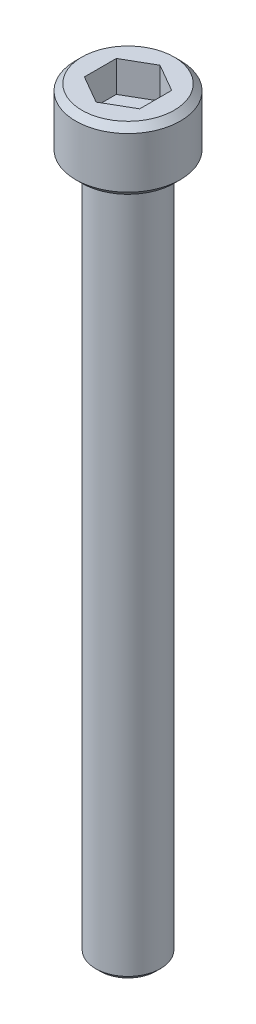
ISO-10303-21;
HEADER;
FILE_DESCRIPTION(('STEP AP214'),'2;1');
FILE_NAME('part.step','',(''),(''),'','','');
FILE_SCHEMA(('AUTOMOTIVE_DESIGN { 1 0 10303 214 1 1 1 1 }'));
ENDSEC;
DATA;
#1=APPLICATION_CONTEXT('core data for automotive mechanical design processes');
#2=APPLICATION_PROTOCOL_DEFINITION('international standard','automotive_design',2000,#1);
#3=PRODUCT_CONTEXT('',#1,'mechanical');
#4=PRODUCT('Part','Part','',(#3));
#5=PRODUCT_RELATED_PRODUCT_CATEGORY('part','',(#4));
#6=PRODUCT_DEFINITION_FORMATION('','',#4);
#7=PRODUCT_DEFINITION_CONTEXT('part definition',#1,'design');
#8=PRODUCT_DEFINITION('design','',#6,#7);
#9=PRODUCT_DEFINITION_SHAPE('','',#8);
#10=(LENGTH_UNIT() NAMED_UNIT(*) SI_UNIT(.MILLI.,.METRE.));
#11=(NAMED_UNIT(*) PLANE_ANGLE_UNIT() SI_UNIT($,.RADIAN.));
#12=(NAMED_UNIT(*) SI_UNIT($,.STERADIAN.) SOLID_ANGLE_UNIT());
#13=UNCERTAINTY_MEASURE_WITH_UNIT(LENGTH_MEASURE(1.E-05),#10,'distance_accuracy_value','');
#14=(GEOMETRIC_REPRESENTATION_CONTEXT(3) GLOBAL_UNCERTAINTY_ASSIGNED_CONTEXT((#13)) GLOBAL_UNIT_ASSIGNED_CONTEXT((#10,
#11,#12)) REPRESENTATION_CONTEXT('',''));
#15=CARTESIAN_POINT('',(0.,0.,0.));
#16=DIRECTION('',(0.,0.,1.));
#17=DIRECTION('',(1.,0.,0.));
#18=AXIS2_PLACEMENT_3D('',#15,#16,#17);
#19=CARTESIAN_POINT('',(1.778,2.064,3.07958633585746));
#20=DIRECTION('',(0.,1.,0.));
#21=DIRECTION('',(0.,0.,1.));
#22=AXIS2_PLACEMENT_3D('',#19,#20,#21);
#23=PLANE('',#22);
#24=DIRECTION('',(-0.866025403784439,0.,0.5));
#25=VECTOR('',#24,1.);
#26=CARTESIAN_POINT('',(0.,2.064,-2.05305755723831));
#27=LINE('',#26,#25);
#28=CARTESIAN_POINT('',(0.,2.064,-2.05305755723831));
#29=VERTEX_POINT('',#28);
#30=CARTESIAN_POINT('',(-1.778,2.064,-1.02652877861915));
#31=VERTEX_POINT('',#30);
#32=EDGE_CURVE('E68',#29,#31,#27,.T.);
#33=ORIENTED_EDGE('',*,*,#32,.T.);
#34=DIRECTION('',(0.,0.,1.));
#35=VECTOR('',#34,1.);
#36=CARTESIAN_POINT('',(-1.778,2.064,-1.02652877861915));
#37=LINE('',#36,#35);
#38=CARTESIAN_POINT('',(-1.778,2.064,1.02652877861916));
#39=VERTEX_POINT('',#38);
#40=EDGE_CURVE('E70',#31,#39,#37,.T.);
#41=ORIENTED_EDGE('',*,*,#40,.T.);
#42=DIRECTION('',(0.866025403784439,0.,0.499999999999999));
#43=VECTOR('',#42,1.);
#44=CARTESIAN_POINT('',(-1.778,2.064,1.02652877861916));
#45=LINE('',#44,#43);
#46=CARTESIAN_POINT('',(0.,2.064,2.05305755723831));
#47=VERTEX_POINT('',#46);
#48=EDGE_CURVE('E72',#39,#47,#45,.T.);
#49=ORIENTED_EDGE('',*,*,#48,.T.);
#50=DIRECTION('',(0.866025403784438,0.,-0.500000000000001));
#51=VECTOR('',#50,1.);
#52=CARTESIAN_POINT('',(0.,2.064,2.05305755723831));
#53=LINE('',#52,#51);
#54=CARTESIAN_POINT('',(1.778,2.064,1.02652877861915));
#55=VERTEX_POINT('',#54);
#56=EDGE_CURVE('E127',#47,#55,#53,.T.);
#57=ORIENTED_EDGE('',*,*,#56,.T.);
#58=DIRECTION('',(0.,0.,-1.));
#59=VECTOR('',#58,1.);
#60=CARTESIAN_POINT('',(1.778,2.064,1.02652877861915));
#61=LINE('',#60,#59);
#62=CARTESIAN_POINT('',(1.778,2.064,-1.02652877861916));
#63=VERTEX_POINT('',#62);
#64=EDGE_CURVE('E132',#55,#63,#61,.T.);
#65=ORIENTED_EDGE('',*,*,#64,.T.);
#66=DIRECTION('',(-0.866025403784439,0.,-0.499999999999999));
#67=VECTOR('',#66,1.);
#68=CARTESIAN_POINT('',(1.778,2.064,-1.02652877861916));
#69=LINE('',#68,#67);
#70=EDGE_CURVE('E136',#63,#29,#69,.T.);
#71=ORIENTED_EDGE('',*,*,#70,.T.);
#72=EDGE_LOOP('',(#33,#41,#49,#57,#65,#71));
#73=FACE_BOUND('',#72,.T.);
#74=ADVANCED_FACE('F17',(#73),#23,.T.);
#75=CARTESIAN_POINT('',(-1.778,2.064,1.02652877861916));
#76=DIRECTION('',(-0.499999999999999,0.,0.866025403784439));
#77=DIRECTION('',(0.866025403784439,0.,0.499999999999999));
#78=AXIS2_PLACEMENT_3D('',#75,#76,#77);
#79=PLANE('',#78);
#80=DIRECTION('',(0.,1.,0.));
#81=VECTOR('',#80,1.);
#82=CARTESIAN_POINT('',(0.,2.064,2.05305755723831));
#83=LINE('',#82,#81);
#84=CARTESIAN_POINT('',(0.,4.064,2.05305755723831));
#85=VERTEX_POINT('',#84);
#86=EDGE_CURVE('E83',#85,#47,#83,.F.);
#87=ORIENTED_EDGE('',*,*,#86,.T.);
#88=ORIENTED_EDGE('',*,*,#48,.F.);
#89=DIRECTION('',(0.,1.,0.));
#90=VECTOR('',#89,1.);
#91=CARTESIAN_POINT('',(-1.778,2.064,1.02652877861916));
#92=LINE('',#91,#90);
#93=CARTESIAN_POINT('',(-1.778,4.064,1.02652877861916));
#94=VERTEX_POINT('',#93);
#95=EDGE_CURVE('E77',#39,#94,#92,.T.);
#96=ORIENTED_EDGE('',*,*,#95,.T.);
#97=DIRECTION('',(-0.866025403784439,0.,-0.5));
#98=VECTOR('',#97,1.);
#99=CARTESIAN_POINT('',(0.,4.064,2.05305755723831));
#100=LINE('',#99,#98);
#101=EDGE_CURVE('E124',#85,#94,#100,.T.);
#102=ORIENTED_EDGE('',*,*,#101,.F.);
#103=EDGE_LOOP('',(#87,#88,#96,#102));
#104=FACE_BOUND('',#103,.T.);
#105=ADVANCED_FACE('F80',(#104),#79,.F.);
#106=CARTESIAN_POINT('',(-1.778,2.064,-1.02652877861915));
#107=DIRECTION('',(-1.,0.,0.));
#108=DIRECTION('',(0.,0.,1.));
#109=AXIS2_PLACEMENT_3D('',#106,#107,#108);
#110=PLANE('',#109);
#111=ORIENTED_EDGE('',*,*,#95,.F.);
#112=ORIENTED_EDGE('',*,*,#40,.F.);
#113=DIRECTION('',(0.,1.,0.));
#114=VECTOR('',#113,1.);
#115=CARTESIAN_POINT('',(-1.778,2.064,-1.02652877861915));
#116=LINE('',#115,#114);
#117=CARTESIAN_POINT('',(-1.778,4.064,-1.02652877861915));
#118=VERTEX_POINT('',#117);
#119=EDGE_CURVE('E91',#31,#118,#116,.T.);
#120=ORIENTED_EDGE('',*,*,#119,.T.);
#121=DIRECTION('',(0.,0.,1.));
#122=VECTOR('',#121,1.);
#123=CARTESIAN_POINT('',(-1.778,4.064,0.));
#124=LINE('',#123,#122);
#125=EDGE_CURVE('E88',#94,#118,#124,.F.);
#126=ORIENTED_EDGE('',*,*,#125,.F.);
#127=EDGE_LOOP('',(#111,#112,#120,#126));
#128=FACE_BOUND('',#127,.T.);
#129=ADVANCED_FACE('F86',(#128),#110,.F.);
#130=CARTESIAN_POINT('',(0.,2.064,-2.05305755723831));
#131=DIRECTION('',(-0.5,0.,-0.866025403784439));
#132=DIRECTION('',(-0.866025403784439,0.,0.5));
#133=AXIS2_PLACEMENT_3D('',#130,#131,#132);
#134=PLANE('',#133);
#135=ORIENTED_EDGE('',*,*,#119,.F.);
#136=ORIENTED_EDGE('',*,*,#32,.F.);
#137=DIRECTION('',(0.,1.,0.));
#138=VECTOR('',#137,1.);
#139=CARTESIAN_POINT('',(0.,2.064,-2.05305755723831));
#140=LINE('',#139,#138);
#141=CARTESIAN_POINT('',(0.,4.064,-2.05305755723831));
#142=VERTEX_POINT('',#141);
#143=EDGE_CURVE('E134',#29,#142,#140,.T.);
#144=ORIENTED_EDGE('',*,*,#143,.T.);
#145=DIRECTION('',(0.866025403784438,0.,-0.5));
#146=VECTOR('',#145,1.);
#147=CARTESIAN_POINT('',(-1.778,4.064,-1.02652877861915));
#148=LINE('',#147,#146);
#149=EDGE_CURVE('E120',#118,#142,#148,.T.);
#150=ORIENTED_EDGE('',*,*,#149,.F.);
#151=EDGE_LOOP('',(#135,#136,#144,#150));
#152=FACE_BOUND('',#151,.T.);
#153=ADVANCED_FACE('F139',(#152),#134,.F.);
#154=CARTESIAN_POINT('',(1.778,2.064,-1.02652877861916));
#155=DIRECTION('',(0.499999999999999,0.,-0.866025403784439));
#156=DIRECTION('',(-0.866025403784439,0.,-0.499999999999999));
#157=AXIS2_PLACEMENT_3D('',#154,#155,#156);
#158=PLANE('',#157);
#159=ORIENTED_EDGE('',*,*,#143,.F.);
#160=ORIENTED_EDGE('',*,*,#70,.F.);
#161=DIRECTION('',(0.,1.,0.));
#162=VECTOR('',#161,1.);
#163=CARTESIAN_POINT('',(1.778,2.064,-1.02652877861916));
#164=LINE('',#163,#162);
#165=CARTESIAN_POINT('',(1.778,4.064,-1.02652877861916));
#166=VERTEX_POINT('',#165);
#167=EDGE_CURVE('E130',#63,#166,#164,.T.);
#168=ORIENTED_EDGE('',*,*,#167,.T.);
#169=DIRECTION('',(0.866025403784439,0.,0.5));
#170=VECTOR('',#169,1.);
#171=CARTESIAN_POINT('',(0.,4.064,-2.05305755723831));
#172=LINE('',#171,#170);
#173=EDGE_CURVE('E117',#142,#166,#172,.T.);
#174=ORIENTED_EDGE('',*,*,#173,.F.);
#175=EDGE_LOOP('',(#159,#160,#168,#174));
#176=FACE_BOUND('',#175,.T.);
#177=ADVANCED_FACE('F151',(#176),#158,.F.);
#178=CARTESIAN_POINT('',(1.778,2.064,1.02652877861915));
#179=DIRECTION('',(1.,0.,0.));
#180=DIRECTION('',(0.,0.,-1.));
#181=AXIS2_PLACEMENT_3D('',#178,#179,#180);
#182=PLANE('',#181);
#183=ORIENTED_EDGE('',*,*,#167,.F.);
#184=ORIENTED_EDGE('',*,*,#64,.F.);
#185=DIRECTION('',(0.,1.,0.));
#186=VECTOR('',#185,1.);
#187=CARTESIAN_POINT('',(1.778,2.064,1.02652877861915));
#188=LINE('',#187,#186);
#189=CARTESIAN_POINT('',(1.778,4.064,1.02652877861915));
#190=VERTEX_POINT('',#189);
#191=EDGE_CURVE('E35',#55,#190,#188,.T.);
#192=ORIENTED_EDGE('',*,*,#191,.T.);
#193=DIRECTION('',(0.,0.,1.));
#194=VECTOR('',#193,1.);
#195=CARTESIAN_POINT('',(1.778,4.064,0.));
#196=LINE('',#195,#194);
#197=EDGE_CURVE('E114',#166,#190,#196,.T.);
#198=ORIENTED_EDGE('',*,*,#197,.F.);
#199=EDGE_LOOP('',(#183,#184,#192,#198));
#200=FACE_BOUND('',#199,.T.);
#201=ADVANCED_FACE('F149',(#200),#182,.F.);
#202=CARTESIAN_POINT('',(0.,2.064,2.05305755723831));
#203=DIRECTION('',(0.500000000000001,0.,0.866025403784438));
#204=DIRECTION('',(0.866025403784438,0.,-0.500000000000001));
#205=AXIS2_PLACEMENT_3D('',#202,#203,#204);
#206=PLANE('',#205);
#207=ORIENTED_EDGE('',*,*,#191,.F.);
#208=ORIENTED_EDGE('',*,*,#56,.F.);
#209=ORIENTED_EDGE('',*,*,#86,.F.);
#210=DIRECTION('',(-0.866025403784438,0.,0.500000000000001));
#211=VECTOR('',#210,1.);
#212=CARTESIAN_POINT('',(1.778,4.064,1.02652877861915));
#213=LINE('',#212,#211);
#214=EDGE_CURVE('E111',#190,#85,#213,.T.);
#215=ORIENTED_EDGE('',*,*,#214,.F.);
#216=EDGE_LOOP('',(#207,#208,#209,#215));
#217=FACE_BOUND('',#216,.T.);
#218=ADVANCED_FACE('F146',(#217),#206,.F.);
#219=CARTESIAN_POINT('',(0.,4.064,0.));
#220=DIRECTION('',(0.,1.,0.));
#221=DIRECTION('',(0.,0.,1.));
#222=AXIS2_PLACEMENT_3D('',#219,#220,#221);
#223=PLANE('',#222);
#224=ORIENTED_EDGE('',*,*,#197,.T.);
#225=ORIENTED_EDGE('',*,*,#214,.T.);
#226=ORIENTED_EDGE('',*,*,#101,.T.);
#227=ORIENTED_EDGE('',*,*,#125,.T.);
#228=ORIENTED_EDGE('',*,*,#149,.T.);
#229=ORIENTED_EDGE('',*,*,#173,.T.);
#230=EDGE_LOOP('',(#224,#225,#226,#227,#228,#229));
#231=FACE_BOUND('',#230,.T.);
#232=CARTESIAN_POINT('',(0.,4.06400000002805,0.));
#233=DIRECTION('',(0.,-1.,0.));
#234=DIRECTION('',(0.,0.,-1.));
#235=AXIS2_PLACEMENT_3D('',#232,#233,#234);
#236=CIRCLE('',#235,2.96550000001616);
#237=CARTESIAN_POINT('',(0.,4.06400000002805,-2.96550000001616));
#238=VERTEX_POINT('',#237);
#239=EDGE_CURVE('E20',#238,#238,#236,.T.);
#240=ORIENTED_EDGE('',*,*,#239,.F.);
#241=EDGE_LOOP('',(#240));
#242=FACE_BOUND('',#241,.T.);
#243=ADVANCED_FACE('F143',(#231,#242),#223,.T.);
#244=CARTESIAN_POINT('',(0.,3.66400000001477,0.));
#245=DIRECTION('',(0.,-1.,0.));
#246=DIRECTION('',(0.,0.,-1.));
#247=AXIS2_PLACEMENT_3D('',#244,#245,#246);
#248=CONICAL_SURFACE('',#247,3.36550000002944,0.785398163397448);
#249=ORIENTED_EDGE('',*,*,#239,.T.);
#250=EDGE_LOOP('',(#249));
#251=FACE_BOUND('',#250,.T.);
#252=CARTESIAN_POINT('',(0.,3.66400000000001,0.));
#253=DIRECTION('',(0.,-1.,0.));
#254=DIRECTION('',(0.,0.,-1.));
#255=AXIS2_PLACEMENT_3D('',#252,#253,#254);
#256=CIRCLE('',#255,3.3655);
#257=CARTESIAN_POINT('',(0.,3.66400000000001,-3.3655));
#258=VERTEX_POINT('',#257);
#259=EDGE_CURVE('E103',#258,#258,#256,.T.);
#260=ORIENTED_EDGE('',*,*,#259,.F.);
#261=EDGE_LOOP('',(#260));
#262=FACE_BOUND('',#261,.T.);
#263=ADVANCED_FACE('F188',(#251,#262),#248,.T.);
#264=CARTESIAN_POINT('',(0.,4.064,0.));
#265=DIRECTION('',(0.,-1.,0.));
#266=DIRECTION('',(0.,0.,-1.));
#267=AXIS2_PLACEMENT_3D('',#264,#265,#266);
#268=CYLINDRICAL_SURFACE('',#267,3.3655);
#269=ORIENTED_EDGE('',*,*,#259,.T.);
#270=EDGE_LOOP('',(#269));
#271=FACE_BOUND('',#270,.T.);
#272=CARTESIAN_POINT('',(0.,0.400000000013279,0.));
#273=DIRECTION('',(0.,1.,0.));
#274=DIRECTION('',(0.,0.,1.));
#275=AXIS2_PLACEMENT_3D('',#272,#273,#274);
#276=CIRCLE('',#275,3.36549999991576);
#277=CARTESIAN_POINT('',(0.,0.400000000013279,3.36549999991576));
#278=VERTEX_POINT('',#277);
#279=EDGE_CURVE('E99',#278,#278,#276,.F.);
#280=ORIENTED_EDGE('',*,*,#279,.F.);
#281=EDGE_LOOP('',(#280));
#282=FACE_BOUND('',#281,.T.);
#283=ADVANCED_FACE('F184',(#271,#282),#268,.T.);
#284=CARTESIAN_POINT('',(0.,-44.45,0.));
#285=DIRECTION('',(0.,1.,0.));
#286=DIRECTION('',(0.,0.,1.));
#287=AXIS2_PLACEMENT_3D('',#284,#285,#286);
#288=PLANE('',#287);
#289=CARTESIAN_POINT('',(0.,-44.4499999999834,0.));
#290=DIRECTION('',(0.,1.,0.));
#291=DIRECTION('',(0.,0.,1.));
#292=AXIS2_PLACEMENT_3D('',#289,#290,#291);
#293=CIRCLE('',#292,1.78280000000086);
#294=CARTESIAN_POINT('',(0.,-44.4499999999834,1.78280000000086));
#295=VERTEX_POINT('',#294);
#296=EDGE_CURVE('E97',#295,#295,#293,.T.);
#297=ORIENTED_EDGE('',*,*,#296,.F.);
#298=EDGE_LOOP('',(#297));
#299=FACE_BOUND('',#298,.T.);
#300=ADVANCED_FACE('F180',(#299),#288,.F.);
#301=CARTESIAN_POINT('',(0.,0.400000000013279,0.));
#302=DIRECTION('',(0.,1.,0.));
#303=DIRECTION('',(0.,0.,1.));
#304=AXIS2_PLACEMENT_3D('',#301,#302,#303);
#305=CONICAL_SURFACE('',#304,3.36549999991576,0.785398163397448);
#306=CARTESIAN_POINT('',(0.,5.6843418860808E-11,0.));
#307=DIRECTION('',(0.,1.,0.));
#308=DIRECTION('',(0.,0.,1.));
#309=AXIS2_PLACEMENT_3D('',#306,#307,#308);
#310=CIRCLE('',#309,2.96549999995932);
#311=CARTESIAN_POINT('',(0.,5.6843418860808E-11,2.96549999995932));
#312=VERTEX_POINT('',#311);
#313=EDGE_CURVE('E95',#312,#312,#310,.T.);
#314=ORIENTED_EDGE('',*,*,#313,.T.);
#315=EDGE_LOOP('',(#314));
#316=FACE_BOUND('',#315,.T.);
#317=ORIENTED_EDGE('',*,*,#279,.T.);
#318=EDGE_LOOP('',(#317));
#319=FACE_BOUND('',#318,.T.);
#320=ADVANCED_FACE('F176',(#316,#319),#305,.T.);
#321=CARTESIAN_POINT('',(0.,-44.1500000000019,0.));
#322=DIRECTION('',(0.,1.,0.));
#323=DIRECTION('',(0.,0.,1.));
#324=AXIS2_PLACEMENT_3D('',#321,#322,#323);
#325=CONICAL_SURFACE('',#324,2.0827999999824,0.785398163397448);
#326=CARTESIAN_POINT('',(0.,-44.15,0.));
#327=DIRECTION('',(0.,1.,0.));
#328=DIRECTION('',(0.,0.,1.));
#329=AXIS2_PLACEMENT_3D('',#326,#327,#328);
#330=CIRCLE('',#329,2.0828);
#331=CARTESIAN_POINT('',(0.,-44.15,2.0828));
#332=VERTEX_POINT('',#331);
#333=EDGE_CURVE('E26',#332,#332,#330,.T.);
#334=ORIENTED_EDGE('',*,*,#333,.F.);
#335=EDGE_LOOP('',(#334));
#336=FACE_BOUND('',#335,.T.);
#337=ORIENTED_EDGE('',*,*,#296,.T.);
#338=EDGE_LOOP('',(#337));
#339=FACE_BOUND('',#338,.T.);
#340=ADVANCED_FACE('F169',(#336,#339),#325,.T.);
#341=CARTESIAN_POINT('',(0.,0.,0.));
#342=DIRECTION('',(0.,1.,0.));
#343=DIRECTION('',(0.,0.,1.));
#344=AXIS2_PLACEMENT_3D('',#341,#342,#343);
#345=PLANE('',#344);
#346=CARTESIAN_POINT('',(0.,0.,0.));
#347=DIRECTION('',(0.,1.,0.));
#348=DIRECTION('',(0.,0.,1.));
#349=AXIS2_PLACEMENT_3D('',#346,#347,#348);
#350=CIRCLE('',#349,2.0828);
#351=CARTESIAN_POINT('',(0.,0.,2.0828));
#352=VERTEX_POINT('',#351);
#353=EDGE_CURVE('E11',#352,#352,#350,.F.);
#354=ORIENTED_EDGE('',*,*,#353,.F.);
#355=EDGE_LOOP('',(#354));
#356=FACE_BOUND('',#355,.T.);
#357=ORIENTED_EDGE('',*,*,#313,.F.);
#358=EDGE_LOOP('',(#357));
#359=FACE_BOUND('',#358,.T.);
#360=ADVANCED_FACE('F163',(#356,#359),#345,.F.);
#361=CARTESIAN_POINT('',(0.,-44.45,0.));
#362=DIRECTION('',(0.,1.,0.));
#363=DIRECTION('',(0.,0.,1.));
#364=AXIS2_PLACEMENT_3D('',#361,#362,#363);
#365=CYLINDRICAL_SURFACE('',#364,2.0828);
#366=ORIENTED_EDGE('',*,*,#353,.T.);
#367=EDGE_LOOP('',(#366));
#368=FACE_BOUND('',#367,.T.);
#369=ORIENTED_EDGE('',*,*,#333,.T.);
#370=EDGE_LOOP('',(#369));
#371=FACE_BOUND('',#370,.T.);
#372=ADVANCED_FACE('F161',(#368,#371),#365,.T.);
#373=CLOSED_SHELL('',(#74,#105,#129,#153,#177,#201,#218,#243,#263,#283,#300,#320,#340,#360,#372));
#374=MANIFOLD_SOLID_BREP('B1',#373);
#375=ADVANCED_BREP_SHAPE_REPRESENTATION('',(#18,#374),#14);
#376=SHAPE_DEFINITION_REPRESENTATION(#9,#375);
ENDSEC;
END-ISO-10303-21;
